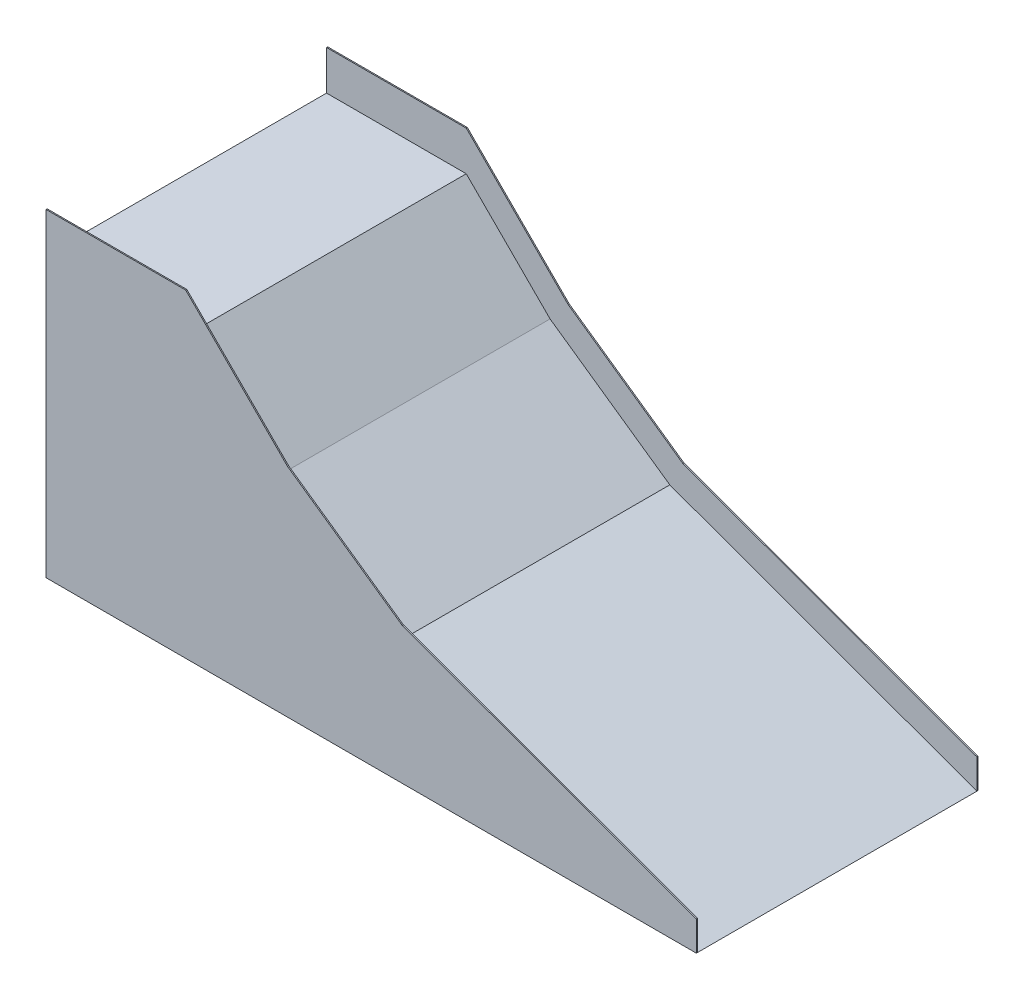
ISO-10303-21;
HEADER;
FILE_DESCRIPTION(('STEP AP214'),'2;1');
FILE_NAME('part.step','',(''),(''),'','','');
FILE_SCHEMA(('AUTOMOTIVE_DESIGN { 1 0 10303 214 1 1 1 1 }'));
ENDSEC;
DATA;
#1=APPLICATION_CONTEXT('core data for automotive mechanical design processes');
#2=APPLICATION_PROTOCOL_DEFINITION('international standard','automotive_design',2000,#1);
#3=PRODUCT_CONTEXT('',#1,'mechanical');
#4=PRODUCT('Part','Part','',(#3));
#5=PRODUCT_RELATED_PRODUCT_CATEGORY('part','',(#4));
#6=PRODUCT_DEFINITION_FORMATION('','',#4);
#7=PRODUCT_DEFINITION_CONTEXT('part definition',#1,'design');
#8=PRODUCT_DEFINITION('design','',#6,#7);
#9=PRODUCT_DEFINITION_SHAPE('','',#8);
#10=(LENGTH_UNIT() NAMED_UNIT(*) SI_UNIT(.MILLI.,.METRE.));
#11=(NAMED_UNIT(*) PLANE_ANGLE_UNIT() SI_UNIT($,.RADIAN.));
#12=(NAMED_UNIT(*) SI_UNIT($,.STERADIAN.) SOLID_ANGLE_UNIT());
#13=UNCERTAINTY_MEASURE_WITH_UNIT(LENGTH_MEASURE(1.E-05),#10,'distance_accuracy_value','');
#14=(GEOMETRIC_REPRESENTATION_CONTEXT(3) GLOBAL_UNCERTAINTY_ASSIGNED_CONTEXT((#13)) GLOBAL_UNIT_ASSIGNED_CONTEXT((#10,
#11,#12)) REPRESENTATION_CONTEXT('',''));
#15=CARTESIAN_POINT('',(0.,0.,0.));
#16=DIRECTION('',(0.,0.,1.));
#17=DIRECTION('',(1.,0.,0.));
#18=AXIS2_PLACEMENT_3D('',#15,#16,#17);
#19=CARTESIAN_POINT('',(2327.43536980451,0.,500.));
#20=DIRECTION('',(0.,1.,0.));
#21=DIRECTION('',(-1.,0.,0.));
#22=AXIS2_PLACEMENT_3D('',#19,#20,#21);
#23=PLANE('',#22);
#24=DIRECTION('',(0.,0.,-1.));
#25=VECTOR('',#24,1.);
#26=CARTESIAN_POINT('',(0.,0.,500.));
#27=LINE('',#26,#25);
#28=CARTESIAN_POINT('',(0.,0.,504.));
#29=VERTEX_POINT('',#28);
#30=CARTESIAN_POINT('',(0.,0.,-504.));
#31=VERTEX_POINT('',#30);
#32=EDGE_CURVE('E147',#29,#31,#27,.T.);
#33=ORIENTED_EDGE('',*,*,#32,.T.);
#34=DIRECTION('',(1.,0.,0.));
#35=VECTOR('',#34,1.);
#36=CARTESIAN_POINT('',(0.,0.,-504.));
#37=LINE('',#36,#35);
#38=CARTESIAN_POINT('',(2327.43536980451,0.,-504.));
#39=VERTEX_POINT('',#38);
#40=EDGE_CURVE('E150',#31,#39,#37,.T.);
#41=ORIENTED_EDGE('',*,*,#40,.T.);
#42=DIRECTION('',(0.,0.,1.));
#43=VECTOR('',#42,1.);
#44=CARTESIAN_POINT('',(2327.43536980451,0.,-504.));
#45=LINE('',#44,#43);
#46=CARTESIAN_POINT('',(2327.43536980451,0.,-500.));
#47=VERTEX_POINT('',#46);
#48=EDGE_CURVE('E191',#39,#47,#45,.T.);
#49=ORIENTED_EDGE('',*,*,#48,.T.);
#50=DIRECTION('',(0.,0.,-1.));
#51=VECTOR('',#50,1.);
#52=CARTESIAN_POINT('',(2327.43536980451,0.,500.));
#53=LINE('',#52,#51);
#54=CARTESIAN_POINT('',(2327.43536980451,0.,500.));
#55=VERTEX_POINT('',#54);
#56=EDGE_CURVE('E11',#55,#47,#53,.T.);
#57=ORIENTED_EDGE('',*,*,#56,.F.);
#58=DIRECTION('',(0.,0.,-1.));
#59=VECTOR('',#58,1.);
#60=CARTESIAN_POINT('',(2327.43536980451,0.,504.));
#61=LINE('',#60,#59);
#62=CARTESIAN_POINT('',(2327.43536980451,0.,504.));
#63=VERTEX_POINT('',#62);
#64=EDGE_CURVE('E259',#63,#55,#61,.T.);
#65=ORIENTED_EDGE('',*,*,#64,.F.);
#66=DIRECTION('',(1.,0.,0.));
#67=VECTOR('',#66,1.);
#68=CARTESIAN_POINT('',(0.,0.,504.));
#69=LINE('',#68,#67);
#70=EDGE_CURVE('E154',#29,#63,#69,.T.);
#71=ORIENTED_EDGE('',*,*,#70,.F.);
#72=EDGE_LOOP('',(#33,#41,#49,#57,#65,#71));
#73=FACE_BOUND('',#72,.T.);
#74=ADVANCED_FACE('F32',(#73),#23,.F.);
#75=CARTESIAN_POINT('',(1228.44440202264,400.,500.));
#76=DIRECTION('',(-0.342020143325663,-0.939692620785911,0.));
#77=DIRECTION('',(0.939692620785911,-0.342020143325663,0.));
#78=AXIS2_PLACEMENT_3D('',#75,#76,#77);
#79=PLANE('',#78);
#80=DIRECTION('',(-0.939692620785911,0.342020143325663,0.));
#81=VECTOR('',#80,1.);
#82=CARTESIAN_POINT('',(1228.44440202264,400.,-500.));
#83=LINE('',#82,#81);
#84=CARTESIAN_POINT('',(1228.44440202264,400.,-500.));
#85=VERTEX_POINT('',#84);
#86=EDGE_CURVE('E262',#47,#85,#83,.T.);
#87=ORIENTED_EDGE('',*,*,#86,.T.);
#88=DIRECTION('',(0.,0.,-1.));
#89=VECTOR('',#88,1.);
#90=CARTESIAN_POINT('',(1228.44440202264,400.,500.));
#91=LINE('',#90,#89);
#92=CARTESIAN_POINT('',(1228.44440202264,400.,500.));
#93=VERTEX_POINT('',#92);
#94=EDGE_CURVE('E40',#93,#85,#91,.T.);
#95=ORIENTED_EDGE('',*,*,#94,.F.);
#96=DIRECTION('',(-0.939692620785911,0.342020143325663,0.));
#97=VECTOR('',#96,1.);
#98=CARTESIAN_POINT('',(1228.44440202264,400.,500.));
#99=LINE('',#98,#97);
#100=EDGE_CURVE('E263',#55,#93,#99,.T.);
#101=ORIENTED_EDGE('',*,*,#100,.F.);
#102=ORIENTED_EDGE('',*,*,#56,.T.);
#103=EDGE_LOOP('',(#87,#95,#101,#102));
#104=FACE_BOUND('',#103,.T.);
#105=ADVANCED_FACE('F294',(#104),#79,.F.);
#106=CARTESIAN_POINT('',(800.000000000004,700.,500.));
#107=DIRECTION('',(-0.573576436351041,-0.819152044288995,0.));
#108=DIRECTION('',(0.819152044288995,-0.573576436351041,0.));
#109=AXIS2_PLACEMENT_3D('',#106,#107,#108);
#110=PLANE('',#109);
#111=DIRECTION('',(-0.819152044288995,0.573576436351041,0.));
#112=VECTOR('',#111,1.);
#113=CARTESIAN_POINT('',(800.000000000004,700.,-500.));
#114=LINE('',#113,#112);
#115=CARTESIAN_POINT('',(800.000000000004,700.,-500.));
#116=VERTEX_POINT('',#115);
#117=EDGE_CURVE('E277',#85,#116,#114,.T.);
#118=ORIENTED_EDGE('',*,*,#117,.T.);
#119=DIRECTION('',(0.,0.,-1.));
#120=VECTOR('',#119,1.);
#121=CARTESIAN_POINT('',(800.000000000004,700.,500.));
#122=LINE('',#121,#120);
#123=CARTESIAN_POINT('',(800.000000000004,700.,500.));
#124=VERTEX_POINT('',#123);
#125=EDGE_CURVE('E286',#124,#116,#122,.T.);
#126=ORIENTED_EDGE('',*,*,#125,.F.);
#127=DIRECTION('',(-0.819152044288995,0.573576436351041,0.));
#128=VECTOR('',#127,1.);
#129=CARTESIAN_POINT('',(800.000000000004,700.,500.));
#130=LINE('',#129,#128);
#131=EDGE_CURVE('E266',#93,#124,#130,.T.);
#132=ORIENTED_EDGE('',*,*,#131,.F.);
#133=ORIENTED_EDGE('',*,*,#94,.T.);
#134=EDGE_LOOP('',(#118,#126,#132,#133));
#135=FACE_BOUND('',#134,.T.);
#136=ADVANCED_FACE('F291',(#135),#110,.F.);
#137=CARTESIAN_POINT('',(500.,1000.,500.));
#138=DIRECTION('',(-0.707106781186544,-0.707106781186551,0.));
#139=DIRECTION('',(0.707106781186551,-0.707106781186544,0.));
#140=AXIS2_PLACEMENT_3D('',#137,#138,#139);
#141=PLANE('',#140);
#142=DIRECTION('',(-0.707106781186551,0.707106781186544,0.));
#143=VECTOR('',#142,1.);
#144=CARTESIAN_POINT('',(500.,1000.,-500.));
#145=LINE('',#144,#143);
#146=CARTESIAN_POINT('',(500.,1000.,-500.));
#147=VERTEX_POINT('',#146);
#148=EDGE_CURVE('E280',#116,#147,#145,.T.);
#149=ORIENTED_EDGE('',*,*,#148,.T.);
#150=DIRECTION('',(0.,0.,-1.));
#151=VECTOR('',#150,1.);
#152=CARTESIAN_POINT('',(500.,1000.,500.));
#153=LINE('',#152,#151);
#154=CARTESIAN_POINT('',(500.,1000.,500.));
#155=VERTEX_POINT('',#154);
#156=EDGE_CURVE('E47',#155,#147,#153,.T.);
#157=ORIENTED_EDGE('',*,*,#156,.F.);
#158=DIRECTION('',(-0.707106781186551,0.707106781186544,0.));
#159=VECTOR('',#158,1.);
#160=CARTESIAN_POINT('',(500.,1000.,500.));
#161=LINE('',#160,#159);
#162=EDGE_CURVE('E270',#124,#155,#161,.T.);
#163=ORIENTED_EDGE('',*,*,#162,.F.);
#164=ORIENTED_EDGE('',*,*,#125,.T.);
#165=EDGE_LOOP('',(#149,#157,#163,#164));
#166=FACE_BOUND('',#165,.T.);
#167=ADVANCED_FACE('F324',(#166),#141,.F.);
#168=CARTESIAN_POINT('',(0.,1000.,500.));
#169=DIRECTION('',(0.,-1.,0.));
#170=DIRECTION('',(0.,0.,-1.));
#171=AXIS2_PLACEMENT_3D('',#168,#169,#170);
#172=PLANE('',#171);
#173=DIRECTION('',(-1.,0.,0.));
#174=VECTOR('',#173,1.);
#175=CARTESIAN_POINT('',(0.,1000.,-500.));
#176=LINE('',#175,#174);
#177=CARTESIAN_POINT('',(0.,1000.,-500.));
#178=VERTEX_POINT('',#177);
#179=EDGE_CURVE('E267',#147,#178,#176,.T.);
#180=ORIENTED_EDGE('',*,*,#179,.T.);
#181=DIRECTION('',(0.,0.,-1.));
#182=VECTOR('',#181,1.);
#183=CARTESIAN_POINT('',(0.,1000.,500.));
#184=LINE('',#183,#182);
#185=CARTESIAN_POINT('',(0.,1000.,500.));
#186=VERTEX_POINT('',#185);
#187=EDGE_CURVE('E159',#186,#178,#184,.T.);
#188=ORIENTED_EDGE('',*,*,#187,.F.);
#189=DIRECTION('',(-1.,0.,0.));
#190=VECTOR('',#189,1.);
#191=CARTESIAN_POINT('',(0.,1000.,500.));
#192=LINE('',#191,#190);
#193=EDGE_CURVE('E160',#155,#186,#192,.T.);
#194=ORIENTED_EDGE('',*,*,#193,.F.);
#195=ORIENTED_EDGE('',*,*,#156,.T.);
#196=EDGE_LOOP('',(#180,#188,#194,#195));
#197=FACE_BOUND('',#196,.T.);
#198=ADVANCED_FACE('F317',(#197),#172,.F.);
#199=CARTESIAN_POINT('',(0.,0.,500.));
#200=DIRECTION('',(1.,0.,0.));
#201=DIRECTION('',(0.,0.,-1.));
#202=AXIS2_PLACEMENT_3D('',#199,#200,#201);
#203=PLANE('',#202);
#204=ORIENTED_EDGE('',*,*,#187,.T.);
#205=DIRECTION('',(0.,-1.,0.));
#206=VECTOR('',#205,1.);
#207=CARTESIAN_POINT('',(0.,0.,-500.));
#208=LINE('',#207,#206);
#209=CARTESIAN_POINT('',(0.,1141.42135623731,-500.));
#210=VERTEX_POINT('',#209);
#211=EDGE_CURVE('E192',#210,#178,#208,.T.);
#212=ORIENTED_EDGE('',*,*,#211,.F.);
#213=DIRECTION('',(0.,0.,1.));
#214=VECTOR('',#213,1.);
#215=CARTESIAN_POINT('',(0.,1141.42135623731,-504.));
#216=LINE('',#215,#214);
#217=CARTESIAN_POINT('',(0.,1141.42135623731,-504.));
#218=VERTEX_POINT('',#217);
#219=EDGE_CURVE('E176',#218,#210,#216,.T.);
#220=ORIENTED_EDGE('',*,*,#219,.F.);
#221=DIRECTION('',(0.,-1.,0.));
#222=VECTOR('',#221,1.);
#223=CARTESIAN_POINT('',(0.,0.,-504.));
#224=LINE('',#223,#222);
#225=EDGE_CURVE('E166',#218,#31,#224,.T.);
#226=ORIENTED_EDGE('',*,*,#225,.T.);
#227=ORIENTED_EDGE('',*,*,#32,.F.);
#228=DIRECTION('',(0.,-1.,0.));
#229=VECTOR('',#228,1.);
#230=CARTESIAN_POINT('',(0.,0.,504.));
#231=LINE('',#230,#229);
#232=CARTESIAN_POINT('',(0.,1141.42135623731,504.));
#233=VERTEX_POINT('',#232);
#234=EDGE_CURVE('E231',#233,#29,#231,.T.);
#235=ORIENTED_EDGE('',*,*,#234,.F.);
#236=DIRECTION('',(0.,0.,-1.));
#237=VECTOR('',#236,1.);
#238=CARTESIAN_POINT('',(0.,1141.42135623731,504.));
#239=LINE('',#238,#237);
#240=CARTESIAN_POINT('',(0.,1141.42135623731,500.));
#241=VERTEX_POINT('',#240);
#242=EDGE_CURVE('E233',#233,#241,#239,.T.);
#243=ORIENTED_EDGE('',*,*,#242,.T.);
#244=DIRECTION('',(0.,-1.,0.));
#245=VECTOR('',#244,1.);
#246=CARTESIAN_POINT('',(0.,0.,500.));
#247=LINE('',#246,#245);
#248=EDGE_CURVE('E221',#241,#186,#247,.T.);
#249=ORIENTED_EDGE('',*,*,#248,.T.);
#250=EDGE_LOOP('',(#204,#212,#220,#226,#227,#235,#243,#249));
#251=FACE_BOUND('',#250,.T.);
#252=ADVANCED_FACE('F174',(#251),#203,.F.);
#253=CARTESIAN_POINT('',(2327.43536980451,106.417777247591,504.));
#254=DIRECTION('',(-1.,0.,0.));
#255=DIRECTION('',(0.,0.,1.));
#256=AXIS2_PLACEMENT_3D('',#253,#254,#255);
#257=PLANE('',#256);
#258=DIRECTION('',(0.,1.,0.));
#259=VECTOR('',#258,1.);
#260=CARTESIAN_POINT('',(2327.43536980451,106.417777247591,500.));
#261=LINE('',#260,#259);
#262=CARTESIAN_POINT('',(2327.43536980451,106.417777247591,500.));
#263=VERTEX_POINT('',#262);
#264=EDGE_CURVE('E218',#55,#263,#261,.T.);
#265=ORIENTED_EDGE('',*,*,#264,.T.);
#266=DIRECTION('',(0.,0.,-1.));
#267=VECTOR('',#266,1.);
#268=CARTESIAN_POINT('',(2327.43536980451,106.417777247591,504.));
#269=LINE('',#268,#267);
#270=CARTESIAN_POINT('',(2327.43536980451,106.417777247591,504.));
#271=VERTEX_POINT('',#270);
#272=EDGE_CURVE('E256',#271,#263,#269,.T.);
#273=ORIENTED_EDGE('',*,*,#272,.F.);
#274=DIRECTION('',(0.,1.,0.));
#275=VECTOR('',#274,1.);
#276=CARTESIAN_POINT('',(2327.43536980451,106.417777247591,504.));
#277=LINE('',#276,#275);
#278=EDGE_CURVE('E220',#63,#271,#277,.T.);
#279=ORIENTED_EDGE('',*,*,#278,.F.);
#280=ORIENTED_EDGE('',*,*,#64,.T.);
#281=EDGE_LOOP('',(#265,#273,#279,#280));
#282=FACE_BOUND('',#281,.T.);
#283=ADVANCED_FACE('F363',(#282),#257,.F.);
#284=CARTESIAN_POINT('',(1275.0177044043,489.466481469189,504.));
#285=DIRECTION('',(-0.342020143325663,-0.939692620785911,0.));
#286=DIRECTION('',(0.939692620785911,-0.342020143325663,0.));
#287=AXIS2_PLACEMENT_3D('',#284,#285,#286);
#288=PLANE('',#287);
#289=DIRECTION('',(-0.939692620785911,0.342020143325663,0.));
#290=VECTOR('',#289,1.);
#291=CARTESIAN_POINT('',(1275.0177044043,489.466481469189,500.));
#292=LINE('',#291,#290);
#293=CARTESIAN_POINT('',(1275.0177044043,489.466481469189,500.));
#294=VERTEX_POINT('',#293);
#295=EDGE_CURVE('E235',#263,#294,#292,.T.);
#296=ORIENTED_EDGE('',*,*,#295,.T.);
#297=DIRECTION('',(0.,0.,-1.));
#298=VECTOR('',#297,1.);
#299=CARTESIAN_POINT('',(1275.0177044043,489.466481469189,504.));
#300=LINE('',#299,#298);
#301=CARTESIAN_POINT('',(1275.0177044043,489.466481469189,504.));
#302=VERTEX_POINT('',#301);
#303=EDGE_CURVE('E253',#302,#294,#300,.T.);
#304=ORIENTED_EDGE('',*,*,#303,.F.);
#305=DIRECTION('',(-0.939692620785911,0.342020143325663,0.));
#306=VECTOR('',#305,1.);
#307=CARTESIAN_POINT('',(1275.0177044043,489.466481469189,504.));
#308=LINE('',#307,#306);
#309=EDGE_CURVE('E223',#271,#302,#308,.T.);
#310=ORIENTED_EDGE('',*,*,#309,.F.);
#311=ORIENTED_EDGE('',*,*,#272,.T.);
#312=EDGE_LOOP('',(#296,#304,#310,#311));
#313=FACE_BOUND('',#312,.T.);
#314=ADVANCED_FACE('F444',(#313),#288,.F.);
#315=CARTESIAN_POINT('',(864.524295393045,776.897060844268,504.));
#316=DIRECTION('',(-0.573576436351041,-0.819152044288995,0.));
#317=DIRECTION('',(0.819152044288995,-0.573576436351041,0.));
#318=AXIS2_PLACEMENT_3D('',#315,#316,#317);
#319=PLANE('',#318);
#320=DIRECTION('',(-0.819152044288995,0.573576436351041,0.));
#321=VECTOR('',#320,1.);
#322=CARTESIAN_POINT('',(864.524295393045,776.897060844268,500.));
#323=LINE('',#322,#321);
#324=CARTESIAN_POINT('',(864.524295393045,776.897060844268,500.));
#325=VERTEX_POINT('',#324);
#326=EDGE_CURVE('E237',#294,#325,#323,.T.);
#327=ORIENTED_EDGE('',*,*,#326,.T.);
#328=DIRECTION('',(0.,0.,-1.));
#329=VECTOR('',#328,1.);
#330=CARTESIAN_POINT('',(864.524295393045,776.897060844268,504.));
#331=LINE('',#330,#329);
#332=CARTESIAN_POINT('',(864.524295393045,776.897060844268,504.));
#333=VERTEX_POINT('',#332);
#334=EDGE_CURVE('E250',#333,#325,#331,.T.);
#335=ORIENTED_EDGE('',*,*,#334,.F.);
#336=DIRECTION('',(-0.819152044288995,0.573576436351041,0.));
#337=VECTOR('',#336,1.);
#338=CARTESIAN_POINT('',(864.524295393045,776.897060844268,504.));
#339=LINE('',#338,#337);
#340=EDGE_CURVE('E225',#302,#333,#339,.T.);
#341=ORIENTED_EDGE('',*,*,#340,.F.);
#342=ORIENTED_EDGE('',*,*,#303,.T.);
#343=EDGE_LOOP('',(#327,#335,#341,#342));
#344=FACE_BOUND('',#343,.T.);
#345=ADVANCED_FACE('F440',(#344),#319,.F.);
#346=CARTESIAN_POINT('',(500.,1141.42135623731,504.));
#347=DIRECTION('',(-0.707106781186547,-0.707106781186547,0.));
#348=DIRECTION('',(0.707106781186548,-0.707106781186548,0.));
#349=AXIS2_PLACEMENT_3D('',#346,#347,#348);
#350=PLANE('',#349);
#351=DIRECTION('',(-0.707106781186548,0.707106781186548,0.));
#352=VECTOR('',#351,1.);
#353=CARTESIAN_POINT('',(500.,1141.42135623731,500.));
#354=LINE('',#353,#352);
#355=CARTESIAN_POINT('',(500.,1141.42135623731,500.));
#356=VERTEX_POINT('',#355);
#357=EDGE_CURVE('E239',#325,#356,#354,.T.);
#358=ORIENTED_EDGE('',*,*,#357,.T.);
#359=DIRECTION('',(0.,0.,-1.));
#360=VECTOR('',#359,1.);
#361=CARTESIAN_POINT('',(500.,1141.42135623731,504.));
#362=LINE('',#361,#360);
#363=CARTESIAN_POINT('',(500.,1141.42135623731,504.));
#364=VERTEX_POINT('',#363);
#365=EDGE_CURVE('E247',#364,#356,#362,.T.);
#366=ORIENTED_EDGE('',*,*,#365,.F.);
#367=DIRECTION('',(-0.707106781186548,0.707106781186548,0.));
#368=VECTOR('',#367,1.);
#369=CARTESIAN_POINT('',(500.,1141.42135623731,504.));
#370=LINE('',#369,#368);
#371=EDGE_CURVE('E227',#333,#364,#370,.T.);
#372=ORIENTED_EDGE('',*,*,#371,.F.);
#373=ORIENTED_EDGE('',*,*,#334,.T.);
#374=EDGE_LOOP('',(#358,#366,#372,#373));
#375=FACE_BOUND('',#374,.T.);
#376=ADVANCED_FACE('F436',(#375),#350,.F.);
#377=CARTESIAN_POINT('',(0.,1141.42135623731,504.));
#378=DIRECTION('',(0.,-1.,0.));
#379=DIRECTION('',(0.,0.,-1.));
#380=AXIS2_PLACEMENT_3D('',#377,#378,#379);
#381=PLANE('',#380);
#382=DIRECTION('',(-1.,0.,0.));
#383=VECTOR('',#382,1.);
#384=CARTESIAN_POINT('',(0.,1141.42135623731,500.));
#385=LINE('',#384,#383);
#386=EDGE_CURVE('E241',#356,#241,#385,.T.);
#387=ORIENTED_EDGE('',*,*,#386,.T.);
#388=ORIENTED_EDGE('',*,*,#242,.F.);
#389=DIRECTION('',(-1.,0.,0.));
#390=VECTOR('',#389,1.);
#391=CARTESIAN_POINT('',(0.,1141.42135623731,504.));
#392=LINE('',#391,#390);
#393=EDGE_CURVE('E229',#364,#233,#392,.T.);
#394=ORIENTED_EDGE('',*,*,#393,.F.);
#395=ORIENTED_EDGE('',*,*,#365,.T.);
#396=EDGE_LOOP('',(#387,#388,#394,#395));
#397=FACE_BOUND('',#396,.T.);
#398=ADVANCED_FACE('F431',(#397),#381,.F.);
#399=CARTESIAN_POINT('',(0.,0.,504.));
#400=DIRECTION('',(0.,0.,-1.));
#401=DIRECTION('',(-1.,0.,0.));
#402=AXIS2_PLACEMENT_3D('',#399,#400,#401);
#403=PLANE('',#402);
#404=ORIENTED_EDGE('',*,*,#70,.T.);
#405=ORIENTED_EDGE('',*,*,#278,.T.);
#406=ORIENTED_EDGE('',*,*,#309,.T.);
#407=ORIENTED_EDGE('',*,*,#340,.T.);
#408=ORIENTED_EDGE('',*,*,#371,.T.);
#409=ORIENTED_EDGE('',*,*,#393,.T.);
#410=ORIENTED_EDGE('',*,*,#234,.T.);
#411=EDGE_LOOP('',(#404,#405,#406,#407,#408,#409,#410));
#412=FACE_BOUND('',#411,.T.);
#413=ADVANCED_FACE('F428',(#412),#403,.F.);
#414=CARTESIAN_POINT('',(0.,0.,500.));
#415=DIRECTION('',(0.,0.,-1.));
#416=DIRECTION('',(-1.,0.,0.));
#417=AXIS2_PLACEMENT_3D('',#414,#415,#416);
#418=PLANE('',#417);
#419=ORIENTED_EDGE('',*,*,#264,.F.);
#420=ORIENTED_EDGE('',*,*,#100,.T.);
#421=ORIENTED_EDGE('',*,*,#131,.T.);
#422=ORIENTED_EDGE('',*,*,#162,.T.);
#423=ORIENTED_EDGE('',*,*,#193,.T.);
#424=ORIENTED_EDGE('',*,*,#248,.F.);
#425=ORIENTED_EDGE('',*,*,#386,.F.);
#426=ORIENTED_EDGE('',*,*,#357,.F.);
#427=ORIENTED_EDGE('',*,*,#326,.F.);
#428=ORIENTED_EDGE('',*,*,#295,.F.);
#429=EDGE_LOOP('',(#419,#420,#421,#422,#423,#424,#425,#426,#427,#428));
#430=FACE_BOUND('',#429,.T.);
#431=ADVANCED_FACE('F322',(#430),#418,.T.);
#432=CARTESIAN_POINT('',(0.,0.,-500.));
#433=DIRECTION('',(0.,0.,1.));
#434=DIRECTION('',(-1.,0.,0.));
#435=AXIS2_PLACEMENT_3D('',#432,#433,#434);
#436=PLANE('',#435);
#437=ORIENTED_EDGE('',*,*,#179,.F.);
#438=ORIENTED_EDGE('',*,*,#148,.F.);
#439=ORIENTED_EDGE('',*,*,#117,.F.);
#440=ORIENTED_EDGE('',*,*,#86,.F.);
#441=DIRECTION('',(0.,1.,0.));
#442=VECTOR('',#441,1.);
#443=CARTESIAN_POINT('',(2327.43536980451,106.417777247591,-500.));
#444=LINE('',#443,#442);
#445=CARTESIAN_POINT('',(2327.43536980451,106.417777247591,-500.));
#446=VERTEX_POINT('',#445);
#447=EDGE_CURVE('E171',#47,#446,#444,.T.);
#448=ORIENTED_EDGE('',*,*,#447,.T.);
#449=DIRECTION('',(-0.939692620785911,0.342020143325663,0.));
#450=VECTOR('',#449,1.);
#451=CARTESIAN_POINT('',(1275.0177044043,489.466481469189,-500.));
#452=LINE('',#451,#450);
#453=CARTESIAN_POINT('',(1275.0177044043,489.466481469189,-500.));
#454=VERTEX_POINT('',#453);
#455=EDGE_CURVE('E203',#446,#454,#452,.T.);
#456=ORIENTED_EDGE('',*,*,#455,.T.);
#457=DIRECTION('',(-0.819152044288995,0.573576436351041,0.));
#458=VECTOR('',#457,1.);
#459=CARTESIAN_POINT('',(864.524295393045,776.897060844268,-500.));
#460=LINE('',#459,#458);
#461=CARTESIAN_POINT('',(864.524295393045,776.897060844268,-500.));
#462=VERTEX_POINT('',#461);
#463=EDGE_CURVE('E200',#454,#462,#460,.T.);
#464=ORIENTED_EDGE('',*,*,#463,.T.);
#465=DIRECTION('',(-0.707106781186548,0.707106781186548,0.));
#466=VECTOR('',#465,1.);
#467=CARTESIAN_POINT('',(500.,1141.42135623731,-500.));
#468=LINE('',#467,#466);
#469=CARTESIAN_POINT('',(500.,1141.42135623731,-500.));
#470=VERTEX_POINT('',#469);
#471=EDGE_CURVE('E197',#462,#470,#468,.T.);
#472=ORIENTED_EDGE('',*,*,#471,.T.);
#473=DIRECTION('',(-1.,0.,0.));
#474=VECTOR('',#473,1.);
#475=CARTESIAN_POINT('',(0.,1141.42135623731,-500.));
#476=LINE('',#475,#474);
#477=EDGE_CURVE('E194',#470,#210,#476,.T.);
#478=ORIENTED_EDGE('',*,*,#477,.T.);
#479=ORIENTED_EDGE('',*,*,#211,.T.);
#480=EDGE_LOOP('',(#437,#438,#439,#440,#448,#456,#464,#472,#478,#479));
#481=FACE_BOUND('',#480,.T.);
#482=ADVANCED_FACE('F297',(#481),#436,.T.);
#483=CARTESIAN_POINT('',(0.,1141.42135623731,-504.));
#484=DIRECTION('',(0.,1.,0.));
#485=DIRECTION('',(0.,0.,1.));
#486=AXIS2_PLACEMENT_3D('',#483,#484,#485);
#487=PLANE('',#486);
#488=ORIENTED_EDGE('',*,*,#477,.F.);
#489=DIRECTION('',(0.,0.,1.));
#490=VECTOR('',#489,1.);
#491=CARTESIAN_POINT('',(500.,1141.42135623731,-504.));
#492=LINE('',#491,#490);
#493=CARTESIAN_POINT('',(500.,1141.42135623731,-504.));
#494=VERTEX_POINT('',#493);
#495=EDGE_CURVE('E215',#494,#470,#492,.T.);
#496=ORIENTED_EDGE('',*,*,#495,.F.);
#497=DIRECTION('',(-1.,0.,0.));
#498=VECTOR('',#497,1.);
#499=CARTESIAN_POINT('',(0.,1141.42135623731,-504.));
#500=LINE('',#499,#498);
#501=EDGE_CURVE('E177',#494,#218,#500,.T.);
#502=ORIENTED_EDGE('',*,*,#501,.T.);
#503=ORIENTED_EDGE('',*,*,#219,.T.);
#504=EDGE_LOOP('',(#488,#496,#502,#503));
#505=FACE_BOUND('',#504,.T.);
#506=ADVANCED_FACE('F315',(#505),#487,.T.);
#507=CARTESIAN_POINT('',(500.,1141.42135623731,-504.));
#508=DIRECTION('',(0.707106781186547,0.707106781186547,0.));
#509=DIRECTION('',(-0.707106781186548,0.707106781186548,0.));
#510=AXIS2_PLACEMENT_3D('',#507,#508,#509);
#511=PLANE('',#510);
#512=ORIENTED_EDGE('',*,*,#471,.F.);
#513=DIRECTION('',(0.,0.,1.));
#514=VECTOR('',#513,1.);
#515=CARTESIAN_POINT('',(864.524295393045,776.897060844268,-504.));
#516=LINE('',#515,#514);
#517=CARTESIAN_POINT('',(864.524295393045,776.897060844268,-504.));
#518=VERTEX_POINT('',#517);
#519=EDGE_CURVE('E213',#518,#462,#516,.T.);
#520=ORIENTED_EDGE('',*,*,#519,.F.);
#521=DIRECTION('',(-0.707106781186548,0.707106781186548,0.));
#522=VECTOR('',#521,1.);
#523=CARTESIAN_POINT('',(500.,1141.42135623731,-504.));
#524=LINE('',#523,#522);
#525=EDGE_CURVE('E179',#518,#494,#524,.T.);
#526=ORIENTED_EDGE('',*,*,#525,.T.);
#527=ORIENTED_EDGE('',*,*,#495,.T.);
#528=EDGE_LOOP('',(#512,#520,#526,#527));
#529=FACE_BOUND('',#528,.T.);
#530=ADVANCED_FACE('F312',(#529),#511,.T.);
#531=CARTESIAN_POINT('',(864.524295393045,776.897060844268,-504.));
#532=DIRECTION('',(0.573576436351041,0.819152044288995,0.));
#533=DIRECTION('',(-0.819152044288995,0.573576436351041,0.));
#534=AXIS2_PLACEMENT_3D('',#531,#532,#533);
#535=PLANE('',#534);
#536=ORIENTED_EDGE('',*,*,#463,.F.);
#537=DIRECTION('',(0.,0.,1.));
#538=VECTOR('',#537,1.);
#539=CARTESIAN_POINT('',(1275.0177044043,489.466481469189,-504.));
#540=LINE('',#539,#538);
#541=CARTESIAN_POINT('',(1275.0177044043,489.466481469189,-504.));
#542=VERTEX_POINT('',#541);
#543=EDGE_CURVE('E211',#542,#454,#540,.T.);
#544=ORIENTED_EDGE('',*,*,#543,.F.);
#545=DIRECTION('',(-0.819152044288995,0.573576436351041,0.));
#546=VECTOR('',#545,1.);
#547=CARTESIAN_POINT('',(864.524295393045,776.897060844268,-504.));
#548=LINE('',#547,#546);
#549=EDGE_CURVE('E184',#542,#518,#548,.T.);
#550=ORIENTED_EDGE('',*,*,#549,.T.);
#551=ORIENTED_EDGE('',*,*,#519,.T.);
#552=EDGE_LOOP('',(#536,#544,#550,#551));
#553=FACE_BOUND('',#552,.T.);
#554=ADVANCED_FACE('F308',(#553),#535,.T.);
#555=CARTESIAN_POINT('',(1275.0177044043,489.466481469189,-504.));
#556=DIRECTION('',(0.342020143325663,0.939692620785911,0.));
#557=DIRECTION('',(-0.939692620785911,0.342020143325663,0.));
#558=AXIS2_PLACEMENT_3D('',#555,#556,#557);
#559=PLANE('',#558);
#560=ORIENTED_EDGE('',*,*,#455,.F.);
#561=DIRECTION('',(0.,0.,1.));
#562=VECTOR('',#561,1.);
#563=CARTESIAN_POINT('',(2327.43536980451,106.417777247591,-504.));
#564=LINE('',#563,#562);
#565=CARTESIAN_POINT('',(2327.43536980451,106.417777247591,-504.));
#566=VERTEX_POINT('',#565);
#567=EDGE_CURVE('E209',#566,#446,#564,.T.);
#568=ORIENTED_EDGE('',*,*,#567,.F.);
#569=DIRECTION('',(-0.939692620785911,0.342020143325663,0.));
#570=VECTOR('',#569,1.);
#571=CARTESIAN_POINT('',(1275.0177044043,489.466481469189,-504.));
#572=LINE('',#571,#570);
#573=EDGE_CURVE('E187',#566,#542,#572,.T.);
#574=ORIENTED_EDGE('',*,*,#573,.T.);
#575=ORIENTED_EDGE('',*,*,#543,.T.);
#576=EDGE_LOOP('',(#560,#568,#574,#575));
#577=FACE_BOUND('',#576,.T.);
#578=ADVANCED_FACE('F304',(#577),#559,.T.);
#579=CARTESIAN_POINT('',(2327.43536980451,106.417777247591,-504.));
#580=DIRECTION('',(1.,0.,0.));
#581=DIRECTION('',(0.,0.,-1.));
#582=AXIS2_PLACEMENT_3D('',#579,#580,#581);
#583=PLANE('',#582);
#584=ORIENTED_EDGE('',*,*,#447,.F.);
#585=ORIENTED_EDGE('',*,*,#48,.F.);
#586=DIRECTION('',(0.,1.,0.));
#587=VECTOR('',#586,1.);
#588=CARTESIAN_POINT('',(2327.43536980451,106.417777247591,-504.));
#589=LINE('',#588,#587);
#590=EDGE_CURVE('E170',#39,#566,#589,.T.);
#591=ORIENTED_EDGE('',*,*,#590,.T.);
#592=ORIENTED_EDGE('',*,*,#567,.T.);
#593=EDGE_LOOP('',(#584,#585,#591,#592));
#594=FACE_BOUND('',#593,.T.);
#595=ADVANCED_FACE('F301',(#594),#583,.T.);
#596=CARTESIAN_POINT('',(0.,0.,-504.));
#597=DIRECTION('',(0.,0.,1.));
#598=DIRECTION('',(-1.,0.,0.));
#599=AXIS2_PLACEMENT_3D('',#596,#597,#598);
#600=PLANE('',#599);
#601=ORIENTED_EDGE('',*,*,#40,.F.);
#602=ORIENTED_EDGE('',*,*,#225,.F.);
#603=ORIENTED_EDGE('',*,*,#501,.F.);
#604=ORIENTED_EDGE('',*,*,#525,.F.);
#605=ORIENTED_EDGE('',*,*,#549,.F.);
#606=ORIENTED_EDGE('',*,*,#573,.F.);
#607=ORIENTED_EDGE('',*,*,#590,.F.);
#608=EDGE_LOOP('',(#601,#602,#603,#604,#605,#606,#607));
#609=FACE_BOUND('',#608,.T.);
#610=ADVANCED_FACE('F164',(#609),#600,.F.);
#611=CLOSED_SHELL('',(#74,#105,#136,#167,#198,#252,#283,#314,#345,#376,#398,#413,#431,#482,#506,
#530,#554,#578,#595,#610));
#612=MANIFOLD_SOLID_BREP('B2',#611);
#613=ADVANCED_BREP_SHAPE_REPRESENTATION('',(#18,#612),#14);
#614=SHAPE_DEFINITION_REPRESENTATION(#9,#613);
ENDSEC;
END-ISO-10303-21;
